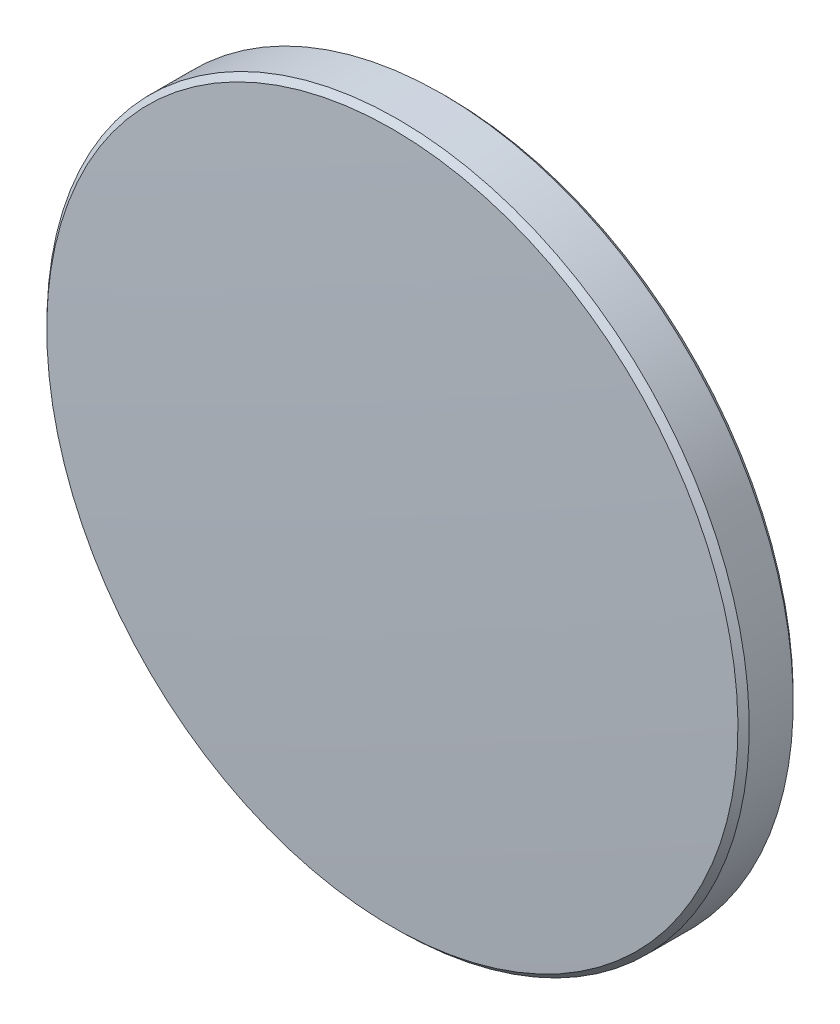
ISO-10303-21;
HEADER;
FILE_DESCRIPTION(('STEP AP214'),'2;1');
FILE_NAME('part.step','',(''),(''),'','','');
FILE_SCHEMA(('AUTOMOTIVE_DESIGN { 1 0 10303 214 1 1 1 1 }'));
ENDSEC;
DATA;
#1=APPLICATION_CONTEXT('core data for automotive mechanical design processes');
#2=APPLICATION_PROTOCOL_DEFINITION('international standard','automotive_design',2000,#1);
#3=PRODUCT_CONTEXT('',#1,'mechanical');
#4=PRODUCT('Part','Part','',(#3));
#5=PRODUCT_RELATED_PRODUCT_CATEGORY('part','',(#4));
#6=PRODUCT_DEFINITION_FORMATION('','',#4);
#7=PRODUCT_DEFINITION_CONTEXT('part definition',#1,'design');
#8=PRODUCT_DEFINITION('design','',#6,#7);
#9=PRODUCT_DEFINITION_SHAPE('','',#8);
#10=(LENGTH_UNIT() NAMED_UNIT(*) SI_UNIT(.MILLI.,.METRE.));
#11=(NAMED_UNIT(*) PLANE_ANGLE_UNIT() SI_UNIT($,.RADIAN.));
#12=(NAMED_UNIT(*) SI_UNIT($,.STERADIAN.) SOLID_ANGLE_UNIT());
#13=UNCERTAINTY_MEASURE_WITH_UNIT(LENGTH_MEASURE(1.E-05),#10,'distance_accuracy_value','');
#14=(GEOMETRIC_REPRESENTATION_CONTEXT(3) GLOBAL_UNCERTAINTY_ASSIGNED_CONTEXT((#13)) GLOBAL_UNIT_ASSIGNED_CONTEXT((#10,
#11,#12)) REPRESENTATION_CONTEXT('',''));
#15=CARTESIAN_POINT('',(0.,0.,0.));
#16=DIRECTION('',(0.,0.,1.));
#17=DIRECTION('',(1.,0.,0.));
#18=AXIS2_PLACEMENT_3D('',#15,#16,#17);
#19=CARTESIAN_POINT('',(0.,0.,-1.12));
#20=DIRECTION('',(0.,0.,-1.));
#21=DIRECTION('',(0.,1.,0.));
#22=AXIS2_PLACEMENT_3D('',#19,#20,#21);
#23=PLANE('',#22);
#24=CARTESIAN_POINT('',(0.,0.,-1.12));
#25=DIRECTION('',(0.,0.,-1.));
#26=DIRECTION('',(0.,1.,0.));
#27=AXIS2_PLACEMENT_3D('',#24,#25,#26);
#28=CIRCLE('',#27,12.5);
#29=CARTESIAN_POINT('',(0.,12.5,-1.12));
#30=VERTEX_POINT('',#29);
#31=EDGE_CURVE('E28',#30,#30,#28,.T.);
#32=ORIENTED_EDGE('',*,*,#31,.T.);
#33=EDGE_LOOP('',(#32));
#34=FACE_BOUND('',#33,.T.);
#35=ADVANCED_FACE('F13',(#34),#23,.T.);
#36=CARTESIAN_POINT('',(0.,0.,-324.29));
#37=DIRECTION('',(0.,0.,-1.));
#38=DIRECTION('',(0.,1.,0.));
#39=AXIS2_PLACEMENT_3D('',#36,#37,#38);
#40=SPHERICAL_SURFACE('',#39,325.41);
#41=CARTESIAN_POINT('',(0.,0.,0.879821408844461));
#42=DIRECTION('',(0.,0.,-1.));
#43=DIRECTION('',(0.,1.,0.));
#44=AXIS2_PLACEMENT_3D('',#41,#42,#43);
#45=CIRCLE('',#44,12.5002137957736);
#46=CARTESIAN_POINT('',(0.,12.5002137957735,0.879821408844465));
#47=VERTEX_POINT('',#46);
#48=EDGE_CURVE('E9',#47,#47,#45,.F.);
#49=ORIENTED_EDGE('',*,*,#48,.T.);
#50=EDGE_LOOP('',(#49));
#51=FACE_BOUND('',#50,.T.);
#52=ADVANCED_FACE('F45',(#51),#40,.T.);
#53=CARTESIAN_POINT('',(0.,0.,-1.12));
#54=DIRECTION('',(0.,0.,-1.));
#55=DIRECTION('',(0.,1.,0.));
#56=AXIS2_PLACEMENT_3D('',#53,#54,#55);
#57=CYLINDRICAL_SURFACE('',#56,12.7);
#58=CARTESIAN_POINT('',(0.,0.,-0.92000000000001));
#59=DIRECTION('',(0.,0.,-1.));
#60=DIRECTION('',(0.,1.,0.));
#61=AXIS2_PLACEMENT_3D('',#58,#59,#60);
#62=CIRCLE('',#61,12.7);
#63=CARTESIAN_POINT('',(0.,12.7,-0.920000000000006));
#64=VERTEX_POINT('',#63);
#65=EDGE_CURVE('E20',#64,#64,#62,.F.);
#66=ORIENTED_EDGE('',*,*,#65,.T.);
#67=EDGE_LOOP('',(#66));
#68=FACE_BOUND('',#67,.T.);
#69=CARTESIAN_POINT('',(0.,0.,0.672079738705089));
#70=DIRECTION('',(0.,0.,1.));
#71=DIRECTION('',(0.,-1.,0.));
#72=AXIS2_PLACEMENT_3D('',#69,#70,#71);
#73=CIRCLE('',#72,12.7);
#74=CARTESIAN_POINT('',(0.,-12.7,0.672079738705085));
#75=VERTEX_POINT('',#74);
#76=EDGE_CURVE('E24',#75,#75,#73,.F.);
#77=ORIENTED_EDGE('',*,*,#76,.T.);
#78=EDGE_LOOP('',(#77));
#79=FACE_BOUND('',#78,.T.);
#80=ADVANCED_FACE('F37',(#68,#79),#57,.T.);
#81=CARTESIAN_POINT('',(0.,0.,-1.12));
#82=DIRECTION('',(0.,0.,1.));
#83=DIRECTION('',(0.,-1.,0.));
#84=AXIS2_PLACEMENT_3D('',#81,#82,#83);
#85=CONICAL_SURFACE('',#84,12.5,0.785398163397448);
#86=ORIENTED_EDGE('',*,*,#65,.F.);
#87=EDGE_LOOP('',(#86));
#88=FACE_BOUND('',#87,.T.);
#89=ORIENTED_EDGE('',*,*,#31,.F.);
#90=EDGE_LOOP('',(#89));
#91=FACE_BOUND('',#90,.T.);
#92=ADVANCED_FACE('F35',(#88,#91),#85,.T.);
#93=CARTESIAN_POINT('',(0.,0.,0.672079738705089));
#94=DIRECTION('',(0.,0.,-1.));
#95=DIRECTION('',(0.,1.,0.));
#96=AXIS2_PLACEMENT_3D('',#93,#94,#95);
#97=CONICAL_SURFACE('',#96,12.7,0.765879362139536);
#98=ORIENTED_EDGE('',*,*,#48,.F.);
#99=EDGE_LOOP('',(#98));
#100=FACE_BOUND('',#99,.T.);
#101=ORIENTED_EDGE('',*,*,#76,.F.);
#102=EDGE_LOOP('',(#101));
#103=FACE_BOUND('',#102,.T.);
#104=ADVANCED_FACE('F15',(#100,#103),#97,.T.);
#105=CLOSED_SHELL('',(#35,#52,#80,#92,#104));
#106=MANIFOLD_SOLID_BREP('B1',#105);
#107=ADVANCED_BREP_SHAPE_REPRESENTATION('',(#18,#106),#14);
#108=SHAPE_DEFINITION_REPRESENTATION(#9,#107);
ENDSEC;
END-ISO-10303-21;
